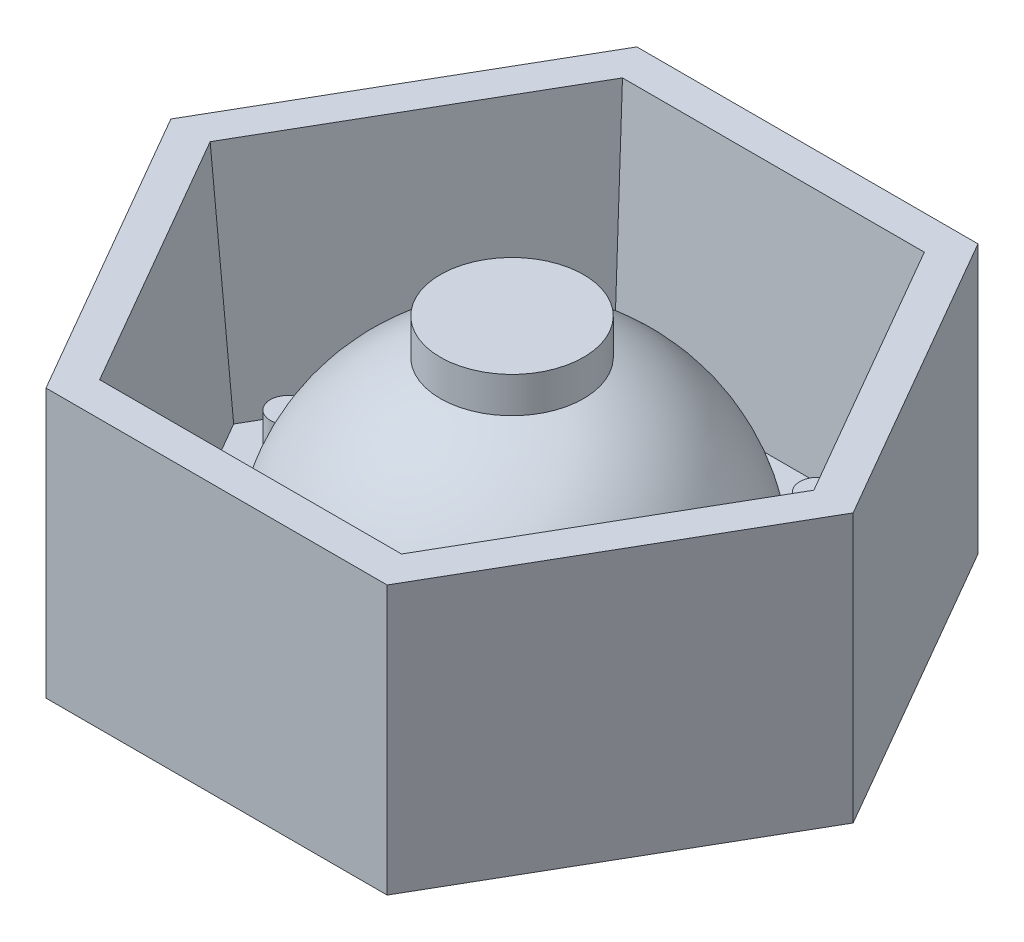
ISO-10303-21;
HEADER;
FILE_DESCRIPTION(('STEP AP214'),'2;1');
FILE_NAME('part.step','',(''),(''),'','','');
FILE_SCHEMA(('AUTOMOTIVE_DESIGN { 1 0 10303 214 1 1 1 1 }'));
ENDSEC;
DATA;
#1=APPLICATION_CONTEXT('core data for automotive mechanical design processes');
#2=APPLICATION_PROTOCOL_DEFINITION('international standard','automotive_design',2000,#1);
#3=PRODUCT_CONTEXT('',#1,'mechanical');
#4=PRODUCT('Part','Part','',(#3));
#5=PRODUCT_RELATED_PRODUCT_CATEGORY('part','',(#4));
#6=PRODUCT_DEFINITION_FORMATION('','',#4);
#7=PRODUCT_DEFINITION_CONTEXT('part definition',#1,'design');
#8=PRODUCT_DEFINITION('design','',#6,#7);
#9=PRODUCT_DEFINITION_SHAPE('','',#8);
#10=(LENGTH_UNIT() NAMED_UNIT(*) SI_UNIT(.MILLI.,.METRE.));
#11=(NAMED_UNIT(*) PLANE_ANGLE_UNIT() SI_UNIT($,.RADIAN.));
#12=(NAMED_UNIT(*) SI_UNIT($,.STERADIAN.) SOLID_ANGLE_UNIT());
#13=UNCERTAINTY_MEASURE_WITH_UNIT(LENGTH_MEASURE(1.E-05),#10,'distance_accuracy_value','');
#14=(GEOMETRIC_REPRESENTATION_CONTEXT(3) GLOBAL_UNCERTAINTY_ASSIGNED_CONTEXT((#13)) GLOBAL_UNIT_ASSIGNED_CONTEXT((#10,
#11,#12)) REPRESENTATION_CONTEXT('',''));
#15=CARTESIAN_POINT('',(0.,0.,0.));
#16=DIRECTION('',(0.,0.,1.));
#17=DIRECTION('',(1.,0.,0.));
#18=AXIS2_PLACEMENT_3D('',#15,#16,#17);
#19=CARTESIAN_POINT('',(47.631397208144,45.,-82.5000000000002));
#20=DIRECTION('',(-0.866025403784438,0.,0.5));
#21=DIRECTION('',(0.5,0.,0.866025403784438));
#22=AXIS2_PLACEMENT_3D('',#19,#20,#21);
#23=PLANE('',#22);
#24=DIRECTION('',(0.,1.,0.));
#25=VECTOR('',#24,1.);
#26=CARTESIAN_POINT('',(47.631397208144,45.,-82.5000000000002));
#27=LINE('',#26,#25);
#28=CARTESIAN_POINT('',(47.631397208144,45.,-82.5000000000002));
#29=VERTEX_POINT('',#28);
#30=CARTESIAN_POINT('',(47.631397208144,120.,-82.5000000000002));
#31=VERTEX_POINT('',#30);
#32=EDGE_CURVE('E192',#29,#31,#27,.T.);
#33=ORIENTED_EDGE('',*,*,#32,.T.);
#34=DIRECTION('',(0.5,0.,0.866025403784438));
#35=VECTOR('',#34,1.);
#36=CARTESIAN_POINT('',(47.631397208144,120.,-82.5000000000002));
#37=LINE('',#36,#35);
#38=CARTESIAN_POINT('',(95.2627944162882,120.,-2.15742407691739E-13));
#39=VERTEX_POINT('',#38);
#40=EDGE_CURVE('E219',#31,#39,#37,.T.);
#41=ORIENTED_EDGE('',*,*,#40,.T.);
#42=DIRECTION('',(0.,1.,0.));
#43=VECTOR('',#42,1.);
#44=CARTESIAN_POINT('',(95.2627944162882,45.,-2.15742407691739E-13));
#45=LINE('',#44,#43);
#46=CARTESIAN_POINT('',(95.2627944162882,45.,-2.15742407691739E-13));
#47=VERTEX_POINT('',#46);
#48=EDGE_CURVE('E11',#47,#39,#45,.T.);
#49=ORIENTED_EDGE('',*,*,#48,.F.);
#50=DIRECTION('',(0.5,0.,0.866025403784438));
#51=VECTOR('',#50,1.);
#52=CARTESIAN_POINT('',(47.631397208144,45.,-82.5000000000002));
#53=LINE('',#52,#51);
#54=EDGE_CURVE('E215',#29,#47,#53,.T.);
#55=ORIENTED_EDGE('',*,*,#54,.F.);
#56=EDGE_LOOP('',(#33,#41,#49,#55));
#57=FACE_BOUND('',#56,.T.);
#58=ADVANCED_FACE('F41',(#57),#23,.F.);
#59=CARTESIAN_POINT('',(95.2627944162882,45.,-2.15742407691739E-13));
#60=DIRECTION('',(-0.866025403784438,0.,-0.5));
#61=DIRECTION('',(-0.5,0.,0.866025403784439));
#62=AXIS2_PLACEMENT_3D('',#59,#60,#61);
#63=PLANE('',#62);
#64=ORIENTED_EDGE('',*,*,#48,.T.);
#65=DIRECTION('',(-0.5,0.,0.866025403784439));
#66=VECTOR('',#65,1.);
#67=CARTESIAN_POINT('',(95.2627944162882,120.,-2.15742407691739E-13));
#68=LINE('',#67,#66);
#69=CARTESIAN_POINT('',(47.6313972081439,120.,82.4999999999999));
#70=VERTEX_POINT('',#69);
#71=EDGE_CURVE('E225',#39,#70,#68,.T.);
#72=ORIENTED_EDGE('',*,*,#71,.T.);
#73=DIRECTION('',(0.,1.,0.));
#74=VECTOR('',#73,1.);
#75=CARTESIAN_POINT('',(47.6313972081439,45.,82.4999999999999));
#76=LINE('',#75,#74);
#77=CARTESIAN_POINT('',(47.6313972081439,45.,82.4999999999999));
#78=VERTEX_POINT('',#77);
#79=EDGE_CURVE('E52',#78,#70,#76,.T.);
#80=ORIENTED_EDGE('',*,*,#79,.F.);
#81=DIRECTION('',(-0.5,0.,0.866025403784438));
#82=VECTOR('',#81,1.);
#83=CARTESIAN_POINT('',(95.2627944162882,45.,-2.15742407691739E-13));
#84=LINE('',#83,#82);
#85=EDGE_CURVE('E211',#47,#78,#84,.T.);
#86=ORIENTED_EDGE('',*,*,#85,.F.);
#87=EDGE_LOOP('',(#64,#72,#80,#86));
#88=FACE_BOUND('',#87,.T.);
#89=ADVANCED_FACE('F320',(#88),#63,.F.);
#90=CARTESIAN_POINT('',(47.6313972081439,45.,82.4999999999999));
#91=DIRECTION('',(0.,0.,-1.));
#92=DIRECTION('',(-1.,0.,0.));
#93=AXIS2_PLACEMENT_3D('',#90,#91,#92);
#94=PLANE('',#93);
#95=ORIENTED_EDGE('',*,*,#79,.T.);
#96=DIRECTION('',(-1.,0.,0.));
#97=VECTOR('',#96,1.);
#98=CARTESIAN_POINT('',(47.6313972081439,120.,82.4999999999999));
#99=LINE('',#98,#97);
#100=CARTESIAN_POINT('',(-47.6313972081442,120.,82.4999999999998));
#101=VERTEX_POINT('',#100);
#102=EDGE_CURVE('E220',#70,#101,#99,.T.);
#103=ORIENTED_EDGE('',*,*,#102,.T.);
#104=DIRECTION('',(0.,1.,0.));
#105=VECTOR('',#104,1.);
#106=CARTESIAN_POINT('',(-47.6313972081442,45.,82.4999999999998));
#107=LINE('',#106,#105);
#108=CARTESIAN_POINT('',(-47.6313972081442,45.,82.4999999999998));
#109=VERTEX_POINT('',#108);
#110=EDGE_CURVE('E180',#109,#101,#107,.T.);
#111=ORIENTED_EDGE('',*,*,#110,.F.);
#112=DIRECTION('',(-1.,0.,0.));
#113=VECTOR('',#112,1.);
#114=CARTESIAN_POINT('',(47.6313972081439,45.,82.4999999999999));
#115=LINE('',#114,#113);
#116=EDGE_CURVE('E207',#78,#109,#115,.T.);
#117=ORIENTED_EDGE('',*,*,#116,.F.);
#118=EDGE_LOOP('',(#95,#103,#111,#117));
#119=FACE_BOUND('',#118,.T.);
#120=ADVANCED_FACE('F326',(#119),#94,.F.);
#121=CARTESIAN_POINT('',(-47.6313972081442,45.,82.4999999999998));
#122=DIRECTION('',(0.866025403784439,0.,-0.5));
#123=DIRECTION('',(-0.5,0.,-0.866025403784439));
#124=AXIS2_PLACEMENT_3D('',#121,#122,#123);
#125=PLANE('',#124);
#126=ORIENTED_EDGE('',*,*,#110,.T.);
#127=DIRECTION('',(-0.5,0.,-0.866025403784439));
#128=VECTOR('',#127,1.);
#129=CARTESIAN_POINT('',(-47.6313972081442,120.,82.4999999999998));
#130=LINE('',#129,#128);
#131=CARTESIAN_POINT('',(-95.2627944162883,120.,-1.66533453693773E-13));
#132=VERTEX_POINT('',#131);
#133=EDGE_CURVE('E224',#101,#132,#130,.T.);
#134=ORIENTED_EDGE('',*,*,#133,.T.);
#135=DIRECTION('',(0.,1.,0.));
#136=VECTOR('',#135,1.);
#137=CARTESIAN_POINT('',(-95.2627944162883,45.,-1.74000782374929E-13));
#138=LINE('',#137,#136);
#139=CARTESIAN_POINT('',(-95.2627944162883,45.,-1.74000782374929E-13));
#140=VERTEX_POINT('',#139);
#141=EDGE_CURVE('E184',#140,#132,#138,.T.);
#142=ORIENTED_EDGE('',*,*,#141,.F.);
#143=DIRECTION('',(-0.5,0.,-0.866025403784439));
#144=VECTOR('',#143,1.);
#145=CARTESIAN_POINT('',(-47.6313972081442,45.,82.4999999999998));
#146=LINE('',#145,#144);
#147=EDGE_CURVE('E203',#109,#140,#146,.T.);
#148=ORIENTED_EDGE('',*,*,#147,.F.);
#149=EDGE_LOOP('',(#126,#134,#142,#148));
#150=FACE_BOUND('',#149,.T.);
#151=ADVANCED_FACE('F393',(#150),#125,.F.);
#152=CARTESIAN_POINT('',(-95.2627944162883,45.,-1.74000782374929E-13));
#153=DIRECTION('',(0.866025403784439,0.,0.5));
#154=DIRECTION('',(0.5,0.,-0.866025403784439));
#155=AXIS2_PLACEMENT_3D('',#152,#153,#154);
#156=PLANE('',#155);
#157=ORIENTED_EDGE('',*,*,#141,.T.);
#158=DIRECTION('',(0.5,0.,-0.866025403784439));
#159=VECTOR('',#158,1.);
#160=CARTESIAN_POINT('',(-95.2627944162883,120.,-1.74000782374929E-13));
#161=LINE('',#160,#159);
#162=CARTESIAN_POINT('',(-47.6313972081442,120.,-82.5000000000002));
#163=VERTEX_POINT('',#162);
#164=EDGE_CURVE('E229',#132,#163,#161,.T.);
#165=ORIENTED_EDGE('',*,*,#164,.T.);
#166=DIRECTION('',(0.,1.,0.));
#167=VECTOR('',#166,1.);
#168=CARTESIAN_POINT('',(-47.6313972081442,45.,-82.5000000000002));
#169=LINE('',#168,#167);
#170=CARTESIAN_POINT('',(-47.6313972081442,45.,-82.5000000000002));
#171=VERTEX_POINT('',#170);
#172=EDGE_CURVE('E188',#171,#163,#169,.T.);
#173=ORIENTED_EDGE('',*,*,#172,.F.);
#174=DIRECTION('',(0.5,0.,-0.866025403784438));
#175=VECTOR('',#174,1.);
#176=CARTESIAN_POINT('',(-95.2627944162883,45.,-1.74000782374929E-13));
#177=LINE('',#176,#175);
#178=EDGE_CURVE('E199',#140,#171,#177,.T.);
#179=ORIENTED_EDGE('',*,*,#178,.F.);
#180=EDGE_LOOP('',(#157,#165,#173,#179));
#181=FACE_BOUND('',#180,.T.);
#182=ADVANCED_FACE('F390',(#181),#156,.F.);
#183=CARTESIAN_POINT('',(-47.6313972081442,45.,-82.5000000000002));
#184=DIRECTION('',(0.,0.,1.));
#185=DIRECTION('',(1.,0.,0.));
#186=AXIS2_PLACEMENT_3D('',#183,#184,#185);
#187=PLANE('',#186);
#188=ORIENTED_EDGE('',*,*,#172,.T.);
#189=DIRECTION('',(1.,0.,0.));
#190=VECTOR('',#189,1.);
#191=CARTESIAN_POINT('',(-47.6313972081442,120.,-82.5000000000002));
#192=LINE('',#191,#190);
#193=EDGE_CURVE('E233',#163,#31,#192,.T.);
#194=ORIENTED_EDGE('',*,*,#193,.T.);
#195=ORIENTED_EDGE('',*,*,#32,.F.);
#196=DIRECTION('',(1.,0.,0.));
#197=VECTOR('',#196,1.);
#198=CARTESIAN_POINT('',(-47.6313972081442,45.,-82.5000000000002));
#199=LINE('',#198,#197);
#200=EDGE_CURVE('E196',#171,#29,#199,.T.);
#201=ORIENTED_EDGE('',*,*,#200,.F.);
#202=EDGE_LOOP('',(#188,#194,#195,#201));
#203=FACE_BOUND('',#202,.T.);
#204=ADVANCED_FACE('F385',(#203),#187,.F.);
#205=CARTESIAN_POINT('',(-200.,45.,-1.66533453693773E-13));
#206=DIRECTION('',(0.,-1.,0.));
#207=DIRECTION('',(0.,0.,-1.));
#208=AXIS2_PLACEMENT_3D('',#205,#206,#207);
#209=PLANE('',#208);
#210=ORIENTED_EDGE('',*,*,#54,.T.);
#211=ORIENTED_EDGE('',*,*,#85,.T.);
#212=ORIENTED_EDGE('',*,*,#116,.T.);
#213=ORIENTED_EDGE('',*,*,#147,.T.);
#214=ORIENTED_EDGE('',*,*,#178,.T.);
#215=ORIENTED_EDGE('',*,*,#200,.T.);
#216=EDGE_LOOP('',(#210,#211,#212,#213,#214,#215));
#217=FACE_BOUND('',#216,.T.);
#218=ADVANCED_FACE('F396',(#217),#209,.T.);
#219=CARTESIAN_POINT('',(-200.,120.,-1.66533453693773E-13));
#220=DIRECTION('',(0.,1.,0.));
#221=DIRECTION('',(0.,0.,1.));
#222=AXIS2_PLACEMENT_3D('',#219,#220,#221);
#223=PLANE('',#222);
#224=DIRECTION('',(-1.,0.,0.));
#225=VECTOR('',#224,1.);
#226=CARTESIAN_POINT('',(0.,120.,-72.9986396231109));
#227=LINE('',#226,#225);
#228=CARTESIAN_POINT('',(42.1457842368795,120.,-72.9986396231109));
#229=VERTEX_POINT('',#228);
#230=CARTESIAN_POINT('',(-42.1457842368796,120.,-72.9986396231109));
#231=VERTEX_POINT('',#230);
#232=EDGE_CURVE('E136',#229,#231,#227,.T.);
#233=ORIENTED_EDGE('',*,*,#232,.F.);
#234=DIRECTION('',(-0.5,0.,-0.866025403784438));
#235=VECTOR('',#234,1.);
#236=CARTESIAN_POINT('',(63.2186763553193,120.,-36.4993198115555));
#237=LINE('',#236,#235);
#238=CARTESIAN_POINT('',(84.2915684737591,120.,0.));
#239=VERTEX_POINT('',#238);
#240=EDGE_CURVE('E132',#239,#229,#237,.T.);
#241=ORIENTED_EDGE('',*,*,#240,.F.);
#242=DIRECTION('',(0.499999999999999,0.,-0.866025403784439));
#243=VECTOR('',#242,1.);
#244=CARTESIAN_POINT('',(63.2186763553194,120.,36.4993198115554));
#245=LINE('',#244,#243);
#246=CARTESIAN_POINT('',(42.1457842368796,120.,72.9986396231109));
#247=VERTEX_POINT('',#246);
#248=EDGE_CURVE('E137',#247,#239,#245,.T.);
#249=ORIENTED_EDGE('',*,*,#248,.F.);
#250=DIRECTION('',(1.,0.,0.));
#251=VECTOR('',#250,1.);
#252=CARTESIAN_POINT('',(0.,120.,72.9986396231109));
#253=LINE('',#252,#251);
#254=CARTESIAN_POINT('',(-42.1457842368795,120.,72.9986396231109));
#255=VERTEX_POINT('',#254);
#256=EDGE_CURVE('E117',#255,#247,#253,.T.);
#257=ORIENTED_EDGE('',*,*,#256,.F.);
#258=DIRECTION('',(0.5,0.,0.866025403784438));
#259=VECTOR('',#258,1.);
#260=CARTESIAN_POINT('',(-63.2186763553193,120.,36.4993198115555));
#261=LINE('',#260,#259);
#262=CARTESIAN_POINT('',(-84.2915684737591,120.,0.));
#263=VERTEX_POINT('',#262);
#264=EDGE_CURVE('E61',#263,#255,#261,.T.);
#265=ORIENTED_EDGE('',*,*,#264,.F.);
#266=DIRECTION('',(-0.499999999999999,0.,0.866025403784439));
#267=VECTOR('',#266,1.);
#268=CARTESIAN_POINT('',(-63.2186763553194,120.,-36.4993198115554));
#269=LINE('',#268,#267);
#270=EDGE_CURVE('E146',#231,#263,#269,.T.);
#271=ORIENTED_EDGE('',*,*,#270,.F.);
#272=EDGE_LOOP('',(#233,#241,#249,#257,#265,#271));
#273=FACE_BOUND('',#272,.T.);
#274=ORIENTED_EDGE('',*,*,#40,.F.);
#275=ORIENTED_EDGE('',*,*,#193,.F.);
#276=ORIENTED_EDGE('',*,*,#164,.F.);
#277=ORIENTED_EDGE('',*,*,#133,.F.);
#278=ORIENTED_EDGE('',*,*,#102,.F.);
#279=ORIENTED_EDGE('',*,*,#71,.F.);
#280=EDGE_LOOP('',(#274,#275,#276,#277,#278,#279));
#281=FACE_BOUND('',#280,.T.);
#282=ADVANCED_FACE('F346',(#273,#281),#223,.T.);
#283=CARTESIAN_POINT('',(0.,55.,0.));
#284=DIRECTION('',(0.,1.,0.));
#285=DIRECTION('',(0.,0.,1.));
#286=AXIS2_PLACEMENT_3D('',#283,#284,#285);
#287=PLANE('',#286);
#288=CARTESIAN_POINT('',(62.5,55.,0.));
#289=DIRECTION('',(0.,1.,0.));
#290=DIRECTION('',(0.,0.,1.));
#291=AXIS2_PLACEMENT_3D('',#288,#289,#290);
#292=CIRCLE('',#291,5.);
#293=CARTESIAN_POINT('',(62.5,55.,5.));
#294=VERTEX_POINT('',#293);
#295=EDGE_CURVE('E128',#294,#294,#292,.T.);
#296=ORIENTED_EDGE('',*,*,#295,.F.);
#297=EDGE_LOOP('',(#296));
#298=FACE_BOUND('',#297,.T.);
#299=CARTESIAN_POINT('',(31.25,55.,-54.1265877365274));
#300=DIRECTION('',(0.,1.,0.));
#301=DIRECTION('',(0.,0.,1.));
#302=AXIS2_PLACEMENT_3D('',#299,#300,#301);
#303=CIRCLE('',#302,5.00000000000001);
#304=CARTESIAN_POINT('',(31.25,55.,-49.1265877365274));
#305=VERTEX_POINT('',#304);
#306=EDGE_CURVE('E145',#305,#305,#303,.T.);
#307=ORIENTED_EDGE('',*,*,#306,.F.);
#308=EDGE_LOOP('',(#307));
#309=FACE_BOUND('',#308,.T.);
#310=CARTESIAN_POINT('',(-31.25,55.,-54.1265877365274));
#311=DIRECTION('',(0.,1.,0.));
#312=DIRECTION('',(0.,0.,1.));
#313=AXIS2_PLACEMENT_3D('',#310,#311,#312);
#314=CIRCLE('',#313,5.);
#315=CARTESIAN_POINT('',(-31.25,55.,-49.1265877365274));
#316=VERTEX_POINT('',#315);
#317=EDGE_CURVE('E246',#316,#316,#314,.T.);
#318=ORIENTED_EDGE('',*,*,#317,.F.);
#319=EDGE_LOOP('',(#318));
#320=FACE_BOUND('',#319,.T.);
#321=CARTESIAN_POINT('',(-62.5,55.,0.));
#322=DIRECTION('',(0.,1.,0.));
#323=DIRECTION('',(0.,0.,1.));
#324=AXIS2_PLACEMENT_3D('',#321,#322,#323);
#325=CIRCLE('',#324,5.);
#326=CARTESIAN_POINT('',(-62.5,55.,5.00000000000001));
#327=VERTEX_POINT('',#326);
#328=EDGE_CURVE('E255',#327,#327,#325,.T.);
#329=ORIENTED_EDGE('',*,*,#328,.F.);
#330=EDGE_LOOP('',(#329));
#331=FACE_BOUND('',#330,.T.);
#332=CARTESIAN_POINT('',(-31.25,55.,54.1265877365274));
#333=DIRECTION('',(0.,1.,0.));
#334=DIRECTION('',(0.,0.,1.));
#335=AXIS2_PLACEMENT_3D('',#332,#333,#334);
#336=CIRCLE('',#335,5.00000000000001);
#337=CARTESIAN_POINT('',(-31.25,55.,59.1265877365274));
#338=VERTEX_POINT('',#337);
#339=EDGE_CURVE('E263',#338,#338,#336,.T.);
#340=ORIENTED_EDGE('',*,*,#339,.F.);
#341=EDGE_LOOP('',(#340));
#342=FACE_BOUND('',#341,.T.);
#343=CARTESIAN_POINT('',(31.25,55.,54.1265877365274));
#344=DIRECTION('',(0.,1.,0.));
#345=DIRECTION('',(0.,0.,1.));
#346=AXIS2_PLACEMENT_3D('',#343,#344,#345);
#347=CIRCLE('',#346,5.00000000000001);
#348=CARTESIAN_POINT('',(31.25,55.,59.1265877365274));
#349=VERTEX_POINT('',#348);
#350=EDGE_CURVE('E271',#349,#349,#347,.T.);
#351=ORIENTED_EDGE('',*,*,#350,.F.);
#352=EDGE_LOOP('',(#351));
#353=FACE_BOUND('',#352,.T.);
#354=CARTESIAN_POINT('',(0.,55.,0.));
#355=DIRECTION('',(0.,1.,0.));
#356=DIRECTION('',(0.,0.,1.));
#357=AXIS2_PLACEMENT_3D('',#354,#355,#356);
#358=CIRCLE('',#357,54.8709661048334);
#359=CARTESIAN_POINT('',(0.,55.,54.8709661048334));
#360=VERTEX_POINT('',#359);
#361=EDGE_CURVE('E107',#360,#360,#358,.T.);
#362=ORIENTED_EDGE('',*,*,#361,.F.);
#363=EDGE_LOOP('',(#362));
#364=FACE_BOUND('',#363,.T.);
#365=DIRECTION('',(1.,0.,0.));
#366=VECTOR('',#365,1.);
#367=CARTESIAN_POINT('',(0.,55.,67.3118764939258));
#368=LINE('',#367,#366);
#369=CARTESIAN_POINT('',(-38.8625300134269,55.,67.3118764939259));
#370=VERTEX_POINT('',#369);
#371=CARTESIAN_POINT('',(38.862530013427,55.,67.3118764939258));
#372=VERTEX_POINT('',#371);
#373=EDGE_CURVE('E110',#370,#372,#368,.T.);
#374=ORIENTED_EDGE('',*,*,#373,.T.);
#375=DIRECTION('',(0.499999999999999,0.,-0.866025403784439));
#376=VECTOR('',#375,1.);
#377=CARTESIAN_POINT('',(58.2937950201404,55.,33.6559382469629));
#378=LINE('',#377,#376);
#379=CARTESIAN_POINT('',(77.7250600268538,55.,0.));
#380=VERTEX_POINT('',#379);
#381=EDGE_CURVE('E45',#372,#380,#378,.T.);
#382=ORIENTED_EDGE('',*,*,#381,.T.);
#383=DIRECTION('',(-0.5,0.,-0.866025403784438));
#384=VECTOR('',#383,1.);
#385=CARTESIAN_POINT('',(58.2937950201404,55.,-33.6559382469629));
#386=LINE('',#385,#384);
#387=CARTESIAN_POINT('',(38.8625300134269,55.,-67.3118764939258));
#388=VERTEX_POINT('',#387);
#389=EDGE_CURVE('E108',#380,#388,#386,.T.);
#390=ORIENTED_EDGE('',*,*,#389,.T.);
#391=DIRECTION('',(-1.,0.,0.));
#392=VECTOR('',#391,1.);
#393=CARTESIAN_POINT('',(0.,55.,-67.3118764939258));
#394=LINE('',#393,#392);
#395=CARTESIAN_POINT('',(-38.862530013427,55.,-67.3118764939258));
#396=VERTEX_POINT('',#395);
#397=EDGE_CURVE('E155',#388,#396,#394,.T.);
#398=ORIENTED_EDGE('',*,*,#397,.T.);
#399=DIRECTION('',(-0.499999999999999,0.,0.866025403784439));
#400=VECTOR('',#399,1.);
#401=CARTESIAN_POINT('',(-58.2937950201404,55.,-33.6559382469629));
#402=LINE('',#401,#400);
#403=CARTESIAN_POINT('',(-77.7250600268538,55.,0.));
#404=VERTEX_POINT('',#403);
#405=EDGE_CURVE('E158',#396,#404,#402,.T.);
#406=ORIENTED_EDGE('',*,*,#405,.T.);
#407=DIRECTION('',(0.5,0.,0.866025403784438));
#408=VECTOR('',#407,1.);
#409=CARTESIAN_POINT('',(-58.2937950201404,55.,33.6559382469629));
#410=LINE('',#409,#408);
#411=EDGE_CURVE('E113',#404,#370,#410,.T.);
#412=ORIENTED_EDGE('',*,*,#411,.T.);
#413=EDGE_LOOP('',(#374,#382,#390,#398,#406,#412));
#414=FACE_BOUND('',#413,.T.);
#415=ADVANCED_FACE('F111',(#298,#309,#320,#331,#342,#353,#364,#414),#287,.T.);
#416=CARTESIAN_POINT('',(54.1265877365274,0.,-31.25));
#417=DIRECTION('',(-0.862729915662821,0.0871557427476584,0.498097349045873));
#418=DIRECTION('',(0.5,0.,0.866025403784438));
#419=AXIS2_PLACEMENT_3D('',#416,#417,#418);
#420=PLANE('',#419);
#421=DIRECTION('',(-0.100511613750393,-0.994935885120892,0.));
#422=VECTOR('',#421,1.);
#423=CARTESIAN_POINT('',(71.9865108399582,-1.8042667064578,0.));
#424=LINE('',#423,#422);
#425=EDGE_CURVE('E103',#239,#380,#424,.T.);
#426=ORIENTED_EDGE('',*,*,#425,.F.);
#427=ORIENTED_EDGE('',*,*,#240,.T.);
#428=DIRECTION('',(-0.0502558068751962,-0.994935885120891,0.0870456108832093));
#429=VECTOR('',#428,1.);
#430=CARTESIAN_POINT('',(35.9932554199791,-1.8042667064578,-62.3421471172077));
#431=LINE('',#430,#429);
#432=EDGE_CURVE('E164',#229,#388,#431,.T.);
#433=ORIENTED_EDGE('',*,*,#432,.T.);
#434=ORIENTED_EDGE('',*,*,#389,.F.);
#435=EDGE_LOOP('',(#426,#427,#433,#434));
#436=FACE_BOUND('',#435,.T.);
#437=ADVANCED_FACE('F331',(#436),#420,.T.);
#438=CARTESIAN_POINT('',(0.,0.,-62.5));
#439=DIRECTION('',(0.,0.0871557427476584,0.996194698091746));
#440=DIRECTION('',(0.,-0.996194698091746,0.0871557427476584));
#441=AXIS2_PLACEMENT_3D('',#438,#439,#440);
#442=PLANE('',#441);
#443=ORIENTED_EDGE('',*,*,#432,.F.);
#444=ORIENTED_EDGE('',*,*,#232,.T.);
#445=DIRECTION('',(0.0502558068751963,-0.994935885120891,0.0870456108832093));
#446=VECTOR('',#445,1.);
#447=CARTESIAN_POINT('',(-35.9932554199791,-1.80426670645781,-62.3421471172077));
#448=LINE('',#447,#446);
#449=EDGE_CURVE('E168',#231,#396,#448,.T.);
#450=ORIENTED_EDGE('',*,*,#449,.T.);
#451=ORIENTED_EDGE('',*,*,#397,.F.);
#452=EDGE_LOOP('',(#443,#444,#450,#451));
#453=FACE_BOUND('',#452,.T.);
#454=ADVANCED_FACE('F315',(#453),#442,.T.);
#455=CARTESIAN_POINT('',(-54.1265877365274,0.,-31.25));
#456=DIRECTION('',(0.862729915662821,0.0871557427476584,0.498097349045872));
#457=DIRECTION('',(0.499999999999999,0.,-0.866025403784439));
#458=AXIS2_PLACEMENT_3D('',#455,#456,#457);
#459=PLANE('',#458);
#460=ORIENTED_EDGE('',*,*,#449,.F.);
#461=ORIENTED_EDGE('',*,*,#270,.T.);
#462=DIRECTION('',(0.100511613750393,-0.994935885120892,0.));
#463=VECTOR('',#462,1.);
#464=CARTESIAN_POINT('',(-71.9865108399582,-1.8042667064578,0.));
#465=LINE('',#464,#463);
#466=EDGE_CURVE('E125',#263,#404,#465,.T.);
#467=ORIENTED_EDGE('',*,*,#466,.T.);
#468=ORIENTED_EDGE('',*,*,#405,.F.);
#469=EDGE_LOOP('',(#460,#461,#467,#468));
#470=FACE_BOUND('',#469,.T.);
#471=ADVANCED_FACE('F307',(#470),#459,.T.);
#472=CARTESIAN_POINT('',(0.,58.765246170202,0.));
#473=DIRECTION('',(0.,1.,0.));
#474=DIRECTION('',(0.,0.,-1.));
#475=AXIS2_PLACEMENT_3D('',#472,#473,#474);
#476=SPHERICAL_SURFACE('',#475,55.);
#477=ORIENTED_EDGE('',*,*,#361,.T.);
#478=EDGE_LOOP('',(#477));
#479=FACE_BOUND('',#478,.T.);
#480=CARTESIAN_POINT('',(0.,110.,0.));
#481=DIRECTION('',(0.,1.,0.));
#482=DIRECTION('',(0.,0.,1.));
#483=AXIS2_PLACEMENT_3D('',#480,#481,#482);
#484=CIRCLE('',#483,20.);
#485=CARTESIAN_POINT('',(0.,110.,19.9999999999999));
#486=VERTEX_POINT('',#485);
#487=EDGE_CURVE('E288',#486,#486,#484,.T.);
#488=ORIENTED_EDGE('',*,*,#487,.F.);
#489=EDGE_LOOP('',(#488));
#490=FACE_BOUND('',#489,.T.);
#491=ADVANCED_FACE('F305',(#479,#490),#476,.T.);
#492=CARTESIAN_POINT('',(54.1265877365274,0.,31.25));
#493=DIRECTION('',(-0.862729915662821,0.0871557427476584,-0.498097349045872));
#494=DIRECTION('',(-0.499999999999999,0.,0.866025403784439));
#495=AXIS2_PLACEMENT_3D('',#492,#493,#494);
#496=PLANE('',#495);
#497=DIRECTION('',(-0.0502558068751963,-0.994935885120892,-0.0870456108832093));
#498=VECTOR('',#497,1.);
#499=CARTESIAN_POINT('',(35.9932554199791,-1.80426670645781,62.3421471172077));
#500=LINE('',#499,#498);
#501=EDGE_CURVE('E100',#247,#372,#500,.T.);
#502=ORIENTED_EDGE('',*,*,#501,.F.);
#503=ORIENTED_EDGE('',*,*,#248,.T.);
#504=ORIENTED_EDGE('',*,*,#425,.T.);
#505=ORIENTED_EDGE('',*,*,#381,.F.);
#506=EDGE_LOOP('',(#502,#503,#504,#505));
#507=FACE_BOUND('',#506,.T.);
#508=ADVANCED_FACE('F97',(#507),#496,.T.);
#509=CARTESIAN_POINT('',(-54.1265877365274,0.,31.25));
#510=DIRECTION('',(0.862729915662821,0.0871557427476584,-0.498097349045873));
#511=DIRECTION('',(-0.5,0.,-0.866025403784438));
#512=AXIS2_PLACEMENT_3D('',#509,#510,#511);
#513=PLANE('',#512);
#514=ORIENTED_EDGE('',*,*,#466,.F.);
#515=ORIENTED_EDGE('',*,*,#264,.T.);
#516=DIRECTION('',(0.0502558068751962,-0.994935885120891,-0.0870456108832093));
#517=VECTOR('',#516,1.);
#518=CARTESIAN_POINT('',(-35.9932554199791,-1.8042667064578,62.3421471172077));
#519=LINE('',#518,#517);
#520=EDGE_CURVE('E120',#255,#370,#519,.T.);
#521=ORIENTED_EDGE('',*,*,#520,.T.);
#522=ORIENTED_EDGE('',*,*,#411,.F.);
#523=EDGE_LOOP('',(#514,#515,#521,#522));
#524=FACE_BOUND('',#523,.T.);
#525=ADVANCED_FACE('F314',(#524),#513,.T.);
#526=CARTESIAN_POINT('',(0.,0.,62.5));
#527=DIRECTION('',(0.,0.0871557427476584,-0.996194698091746));
#528=DIRECTION('',(0.,0.996194698091746,0.0871557427476584));
#529=AXIS2_PLACEMENT_3D('',#526,#527,#528);
#530=PLANE('',#529);
#531=ORIENTED_EDGE('',*,*,#520,.F.);
#532=ORIENTED_EDGE('',*,*,#256,.T.);
#533=ORIENTED_EDGE('',*,*,#501,.T.);
#534=ORIENTED_EDGE('',*,*,#373,.F.);
#535=EDGE_LOOP('',(#531,#532,#533,#534));
#536=FACE_BOUND('',#535,.T.);
#537=ADVANCED_FACE('F43',(#536),#530,.T.);
#538=CARTESIAN_POINT('',(31.25,66.,54.1265877365274));
#539=DIRECTION('',(0.,-1.,0.));
#540=DIRECTION('',(0.,0.,-1.));
#541=AXIS2_PLACEMENT_3D('',#538,#539,#540);
#542=CYLINDRICAL_SURFACE('',#541,5.00000000000001);
#543=CARTESIAN_POINT('',(31.25,66.,54.1265877365274));
#544=DIRECTION('',(0.,1.,0.));
#545=DIRECTION('',(0.,0.,1.));
#546=AXIS2_PLACEMENT_3D('',#543,#544,#545);
#547=CIRCLE('',#546,5.00000000000001);
#548=CARTESIAN_POINT('',(31.25,66.,59.1265877365274));
#549=VERTEX_POINT('',#548);
#550=EDGE_CURVE('E275',#549,#549,#547,.T.);
#551=ORIENTED_EDGE('',*,*,#550,.F.);
#552=EDGE_LOOP('',(#551));
#553=FACE_BOUND('',#552,.T.);
#554=ORIENTED_EDGE('',*,*,#350,.T.);
#555=EDGE_LOOP('',(#554));
#556=FACE_BOUND('',#555,.T.);
#557=ADVANCED_FACE('F335',(#553,#556),#542,.T.);
#558=CARTESIAN_POINT('',(31.25,66.,54.1265877365274));
#559=DIRECTION('',(0.,1.,0.));
#560=DIRECTION('',(0.,0.,1.));
#561=AXIS2_PLACEMENT_3D('',#558,#559,#560);
#562=PLANE('',#561);
#563=ORIENTED_EDGE('',*,*,#550,.T.);
#564=EDGE_LOOP('',(#563));
#565=FACE_BOUND('',#564,.T.);
#566=ADVANCED_FACE('F464',(#565),#562,.T.);
#567=CARTESIAN_POINT('',(-31.25,66.,54.1265877365274));
#568=DIRECTION('',(0.,-1.,0.));
#569=DIRECTION('',(0.,0.,-1.));
#570=AXIS2_PLACEMENT_3D('',#567,#568,#569);
#571=CYLINDRICAL_SURFACE('',#570,5.00000000000001);
#572=CARTESIAN_POINT('',(-31.25,66.,54.1265877365274));
#573=DIRECTION('',(0.,1.,0.));
#574=DIRECTION('',(0.,0.,1.));
#575=AXIS2_PLACEMENT_3D('',#572,#573,#574);
#576=CIRCLE('',#575,5.00000000000001);
#577=CARTESIAN_POINT('',(-31.25,66.,59.1265877365274));
#578=VERTEX_POINT('',#577);
#579=EDGE_CURVE('E267',#578,#578,#576,.T.);
#580=ORIENTED_EDGE('',*,*,#579,.F.);
#581=EDGE_LOOP('',(#580));
#582=FACE_BOUND('',#581,.T.);
#583=ORIENTED_EDGE('',*,*,#339,.T.);
#584=EDGE_LOOP('',(#583));
#585=FACE_BOUND('',#584,.T.);
#586=ADVANCED_FACE('F476',(#582,#585),#571,.T.);
#587=CARTESIAN_POINT('',(-31.25,66.,54.1265877365274));
#588=DIRECTION('',(0.,1.,0.));
#589=DIRECTION('',(0.,0.,1.));
#590=AXIS2_PLACEMENT_3D('',#587,#588,#589);
#591=PLANE('',#590);
#592=ORIENTED_EDGE('',*,*,#579,.T.);
#593=EDGE_LOOP('',(#592));
#594=FACE_BOUND('',#593,.T.);
#595=ADVANCED_FACE('F486',(#594),#591,.T.);
#596=CARTESIAN_POINT('',(-62.5,66.,0.));
#597=DIRECTION('',(0.,-1.,0.));
#598=DIRECTION('',(0.,0.,-1.));
#599=AXIS2_PLACEMENT_3D('',#596,#597,#598);
#600=CYLINDRICAL_SURFACE('',#599,5.);
#601=CARTESIAN_POINT('',(-62.5,66.,0.));
#602=DIRECTION('',(0.,1.,0.));
#603=DIRECTION('',(0.,0.,1.));
#604=AXIS2_PLACEMENT_3D('',#601,#602,#603);
#605=CIRCLE('',#604,5.);
#606=CARTESIAN_POINT('',(-62.5,66.,5.00000000000001));
#607=VERTEX_POINT('',#606);
#608=EDGE_CURVE('E259',#607,#607,#605,.T.);
#609=ORIENTED_EDGE('',*,*,#608,.F.);
#610=EDGE_LOOP('',(#609));
#611=FACE_BOUND('',#610,.T.);
#612=ORIENTED_EDGE('',*,*,#328,.T.);
#613=EDGE_LOOP('',(#612));
#614=FACE_BOUND('',#613,.T.);
#615=ADVANCED_FACE('F496',(#611,#614),#600,.T.);
#616=CARTESIAN_POINT('',(-62.5,66.,0.));
#617=DIRECTION('',(0.,1.,0.));
#618=DIRECTION('',(0.,0.,1.));
#619=AXIS2_PLACEMENT_3D('',#616,#617,#618);
#620=PLANE('',#619);
#621=ORIENTED_EDGE('',*,*,#608,.T.);
#622=EDGE_LOOP('',(#621));
#623=FACE_BOUND('',#622,.T.);
#624=ADVANCED_FACE('F506',(#623),#620,.T.);
#625=CARTESIAN_POINT('',(-31.25,66.,-54.1265877365274));
#626=DIRECTION('',(0.,-1.,0.));
#627=DIRECTION('',(0.,0.,-1.));
#628=AXIS2_PLACEMENT_3D('',#625,#626,#627);
#629=CYLINDRICAL_SURFACE('',#628,5.);
#630=CARTESIAN_POINT('',(-31.25,66.,-54.1265877365274));
#631=DIRECTION('',(0.,1.,0.));
#632=DIRECTION('',(0.,0.,1.));
#633=AXIS2_PLACEMENT_3D('',#630,#631,#632);
#634=CIRCLE('',#633,5.);
#635=CARTESIAN_POINT('',(-31.25,66.,-49.1265877365274));
#636=VERTEX_POINT('',#635);
#637=EDGE_CURVE('E250',#636,#636,#634,.T.);
#638=ORIENTED_EDGE('',*,*,#637,.F.);
#639=EDGE_LOOP('',(#638));
#640=FACE_BOUND('',#639,.T.);
#641=ORIENTED_EDGE('',*,*,#317,.T.);
#642=EDGE_LOOP('',(#641));
#643=FACE_BOUND('',#642,.T.);
#644=ADVANCED_FACE('F516',(#640,#643),#629,.T.);
#645=CARTESIAN_POINT('',(-31.25,66.,-54.1265877365274));
#646=DIRECTION('',(0.,1.,0.));
#647=DIRECTION('',(0.,0.,1.));
#648=AXIS2_PLACEMENT_3D('',#645,#646,#647);
#649=PLANE('',#648);
#650=ORIENTED_EDGE('',*,*,#637,.T.);
#651=EDGE_LOOP('',(#650));
#652=FACE_BOUND('',#651,.T.);
#653=ADVANCED_FACE('F526',(#652),#649,.T.);
#654=CARTESIAN_POINT('',(31.25,66.,-54.1265877365274));
#655=DIRECTION('',(0.,-1.,0.));
#656=DIRECTION('',(0.,0.,-1.));
#657=AXIS2_PLACEMENT_3D('',#654,#655,#656);
#658=CYLINDRICAL_SURFACE('',#657,5.00000000000001);
#659=CARTESIAN_POINT('',(31.25,66.,-54.1265877365274));
#660=DIRECTION('',(0.,1.,0.));
#661=DIRECTION('',(0.,0.,1.));
#662=AXIS2_PLACEMENT_3D('',#659,#660,#661);
#663=CIRCLE('',#662,5.00000000000001);
#664=CARTESIAN_POINT('',(31.25,66.,-49.1265877365274));
#665=VERTEX_POINT('',#664);
#666=EDGE_CURVE('E251',#665,#665,#663,.T.);
#667=ORIENTED_EDGE('',*,*,#666,.F.);
#668=EDGE_LOOP('',(#667));
#669=FACE_BOUND('',#668,.T.);
#670=ORIENTED_EDGE('',*,*,#306,.T.);
#671=EDGE_LOOP('',(#670));
#672=FACE_BOUND('',#671,.T.);
#673=ADVANCED_FACE('F535',(#669,#672),#658,.T.);
#674=CARTESIAN_POINT('',(31.25,66.,-54.1265877365274));
#675=DIRECTION('',(0.,1.,0.));
#676=DIRECTION('',(0.,0.,1.));
#677=AXIS2_PLACEMENT_3D('',#674,#675,#676);
#678=PLANE('',#677);
#679=ORIENTED_EDGE('',*,*,#666,.T.);
#680=EDGE_LOOP('',(#679));
#681=FACE_BOUND('',#680,.T.);
#682=ADVANCED_FACE('F545',(#681),#678,.T.);
#683=CARTESIAN_POINT('',(62.5,66.,0.));
#684=DIRECTION('',(0.,-1.,0.));
#685=DIRECTION('',(0.,0.,-1.));
#686=AXIS2_PLACEMENT_3D('',#683,#684,#685);
#687=CYLINDRICAL_SURFACE('',#686,5.);
#688=CARTESIAN_POINT('',(62.5,66.,0.));
#689=DIRECTION('',(0.,1.,0.));
#690=DIRECTION('',(0.,0.,1.));
#691=AXIS2_PLACEMENT_3D('',#688,#689,#690);
#692=CIRCLE('',#691,5.);
#693=CARTESIAN_POINT('',(62.5,66.,5.));
#694=VERTEX_POINT('',#693);
#695=EDGE_CURVE('E121',#694,#694,#692,.T.);
#696=ORIENTED_EDGE('',*,*,#695,.F.);
#697=EDGE_LOOP('',(#696));
#698=FACE_BOUND('',#697,.T.);
#699=ORIENTED_EDGE('',*,*,#295,.T.);
#700=EDGE_LOOP('',(#699));
#701=FACE_BOUND('',#700,.T.);
#702=ADVANCED_FACE('F555',(#698,#701),#687,.T.);
#703=CARTESIAN_POINT('',(62.5,66.,0.));
#704=DIRECTION('',(0.,1.,0.));
#705=DIRECTION('',(0.,0.,1.));
#706=AXIS2_PLACEMENT_3D('',#703,#704,#705);
#707=PLANE('',#706);
#708=ORIENTED_EDGE('',*,*,#695,.T.);
#709=EDGE_LOOP('',(#708));
#710=FACE_BOUND('',#709,.T.);
#711=ADVANCED_FACE('F301',(#710),#707,.T.);
#712=CARTESIAN_POINT('',(0.,120.,0.));
#713=DIRECTION('',(0.,-1.,0.));
#714=DIRECTION('',(0.,0.,-1.));
#715=AXIS2_PLACEMENT_3D('',#712,#713,#714);
#716=CYLINDRICAL_SURFACE('',#715,20.);
#717=CARTESIAN_POINT('',(0.,120.,0.));
#718=DIRECTION('',(0.,1.,0.));
#719=DIRECTION('',(0.,0.,1.));
#720=AXIS2_PLACEMENT_3D('',#717,#718,#719);
#721=CIRCLE('',#720,20.);
#722=CARTESIAN_POINT('',(0.,120.,19.9999999999999));
#723=VERTEX_POINT('',#722);
#724=EDGE_CURVE('E142',#723,#723,#721,.T.);
#725=ORIENTED_EDGE('',*,*,#724,.F.);
#726=EDGE_LOOP('',(#725));
#727=FACE_BOUND('',#726,.T.);
#728=ORIENTED_EDGE('',*,*,#487,.T.);
#729=EDGE_LOOP('',(#728));
#730=FACE_BOUND('',#729,.T.);
#731=ADVANCED_FACE('F298',(#727,#730),#716,.T.);
#732=ORIENTED_EDGE('',*,*,#724,.T.);
#733=EDGE_LOOP('',(#732));
#734=FACE_BOUND('',#733,.T.);
#735=ADVANCED_FACE('F296',(#734),#223,.T.);
#736=CLOSED_SHELL('',(#58,#89,#120,#151,#182,#204,#218,#282,#415,#437,#454,#471,#491,#508,#525,
#537,#557,#566,#586,#595,#615,#624,#644,#653,#673,#682,#702,#711,#731,#735));
#737=MANIFOLD_SOLID_BREP('B2',#736);
#738=ADVANCED_BREP_SHAPE_REPRESENTATION('',(#18,#737),#14);
#739=SHAPE_DEFINITION_REPRESENTATION(#9,#738);
ENDSEC;
END-ISO-10303-21;
